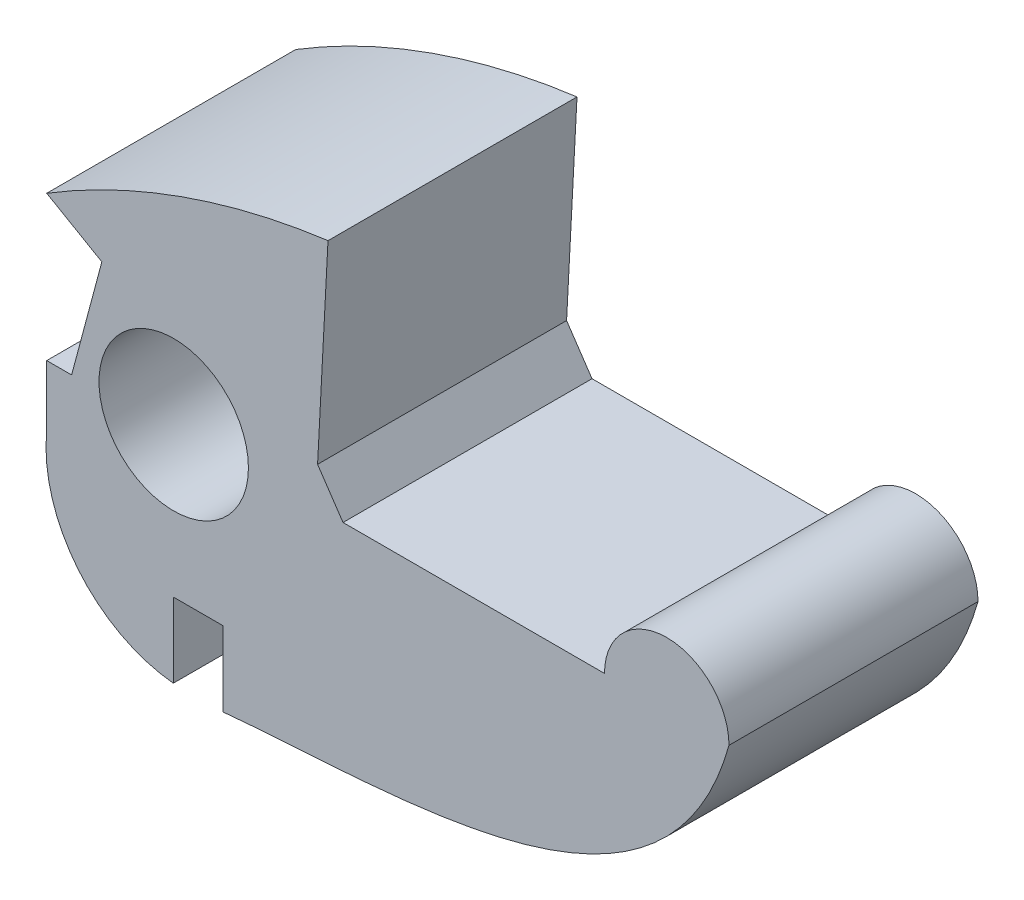
ISO-10303-21;
HEADER;
FILE_DESCRIPTION(('STEP AP214'),'2;1');
FILE_NAME('part.step','',(''),(''),'','','');
FILE_SCHEMA(('AUTOMOTIVE_DESIGN { 1 0 10303 214 1 1 1 1 }'));
ENDSEC;
DATA;
#1=APPLICATION_CONTEXT('core data for automotive mechanical design processes');
#2=APPLICATION_PROTOCOL_DEFINITION('international standard','automotive_design',2000,#1);
#3=PRODUCT_CONTEXT('',#1,'mechanical');
#4=PRODUCT('Part','Part','',(#3));
#5=PRODUCT_RELATED_PRODUCT_CATEGORY('part','',(#4));
#6=PRODUCT_DEFINITION_FORMATION('','',#4);
#7=PRODUCT_DEFINITION_CONTEXT('part definition',#1,'design');
#8=PRODUCT_DEFINITION('design','',#6,#7);
#9=PRODUCT_DEFINITION_SHAPE('','',#8);
#10=(LENGTH_UNIT() NAMED_UNIT(*) SI_UNIT(.MILLI.,.METRE.));
#11=(NAMED_UNIT(*) PLANE_ANGLE_UNIT() SI_UNIT($,.RADIAN.));
#12=(NAMED_UNIT(*) SI_UNIT($,.STERADIAN.) SOLID_ANGLE_UNIT());
#13=UNCERTAINTY_MEASURE_WITH_UNIT(LENGTH_MEASURE(1.E-05),#10,'distance_accuracy_value','');
#14=(GEOMETRIC_REPRESENTATION_CONTEXT(3) GLOBAL_UNCERTAINTY_ASSIGNED_CONTEXT((#13)) GLOBAL_UNIT_ASSIGNED_CONTEXT((#10,
#11,#12)) REPRESENTATION_CONTEXT('',''));
#15=CARTESIAN_POINT('',(0.,0.,0.));
#16=DIRECTION('',(0.,0.,1.));
#17=DIRECTION('',(1.,0.,0.));
#18=AXIS2_PLACEMENT_3D('',#15,#16,#17);
#19=CARTESIAN_POINT('',(15.5,0.,10.));
#20=CARTESIAN_POINT('',(12.9760479301771,-9.01098346788122,10.));
#21=CARTESIAN_POINT('',(2.1152250635475,-8.3312576021562,10.));
#22=CARTESIAN_POINT('',(-4.81703295022904,-9.,10.));
#23=B_SPLINE_CURVE_WITH_KNOTS('',3,(#19,#20,#21,#22),.UNSPECIFIED.,.F.,.F.,(4,4),(0.,1.),.UNSPECIFIED.);
#24=DIRECTION('',(0.,0.,-1.));
#25=VECTOR('',#24,1.);
#26=SURFACE_OF_LINEAR_EXTRUSION('',#23,#25);
#27=CARTESIAN_POINT('',(15.5,0.,0.));
#28=CARTESIAN_POINT('',(12.9760479301771,-9.01098346788122,0.));
#29=CARTESIAN_POINT('',(2.1152250635475,-8.3312576021562,0.));
#30=CARTESIAN_POINT('',(-4.81703295022904,-9.,0.));
#31=B_SPLINE_CURVE_WITH_KNOTS('',3,(#27,#28,#29,#30),.UNSPECIFIED.,.F.,.F.,(4,4),(0.,1.),.UNSPECIFIED.);
#32=CARTESIAN_POINT('',(15.5,0.,0.));
#33=VERTEX_POINT('',#32);
#34=CARTESIAN_POINT('',(-4.8170329502291,-9.,0.));
#35=VERTEX_POINT('',#34);
#36=EDGE_CURVE('E168',#33,#35,#31,.T.);
#37=ORIENTED_EDGE('',*,*,#36,.F.);
#38=DIRECTION('',(0.,0.,-1.));
#39=VECTOR('',#38,1.);
#40=CARTESIAN_POINT('',(15.5,0.,10.));
#41=LINE('',#40,#39);
#42=CARTESIAN_POINT('',(15.5,0.,10.));
#43=VERTEX_POINT('',#42);
#44=EDGE_CURVE('E11',#43,#33,#41,.T.);
#45=ORIENTED_EDGE('',*,*,#44,.F.);
#46=CARTESIAN_POINT('',(-4.8170329502291,-9.,10.));
#47=VERTEX_POINT('',#46);
#48=EDGE_CURVE('E208',#43,#47,#23,.T.);
#49=ORIENTED_EDGE('',*,*,#48,.T.);
#50=DIRECTION('',(0.,0.,-1.));
#51=VECTOR('',#50,1.);
#52=CARTESIAN_POINT('',(-4.8170329502291,-9.,10.));
#53=LINE('',#52,#51);
#54=EDGE_CURVE('E104',#47,#35,#53,.T.);
#55=ORIENTED_EDGE('',*,*,#54,.T.);
#56=EDGE_LOOP('',(#37,#45,#49,#55));
#57=FACE_BOUND('',#56,.T.);
#58=ADVANCED_FACE('F34',(#57),#26,.T.);
#59=CARTESIAN_POINT('',(13.,0.,10.));
#60=DIRECTION('',(0.,0.,-1.));
#61=DIRECTION('',(-1.,0.,0.));
#62=AXIS2_PLACEMENT_3D('',#59,#60,#61);
#63=CYLINDRICAL_SURFACE('',#62,2.5);
#64=CARTESIAN_POINT('',(13.,0.,0.));
#65=DIRECTION('',(0.,0.,1.));
#66=DIRECTION('',(1.,0.,0.));
#67=AXIS2_PLACEMENT_3D('',#64,#65,#66);
#68=CIRCLE('',#67,2.5);
#69=CARTESIAN_POINT('',(10.5,0.,0.));
#70=VERTEX_POINT('',#69);
#71=EDGE_CURVE('E173',#33,#70,#68,.T.);
#72=ORIENTED_EDGE('',*,*,#71,.T.);
#73=DIRECTION('',(0.,0.,-1.));
#74=VECTOR('',#73,1.);
#75=CARTESIAN_POINT('',(10.5,0.,10.));
#76=LINE('',#75,#74);
#77=CARTESIAN_POINT('',(10.5,0.,10.));
#78=VERTEX_POINT('',#77);
#79=EDGE_CURVE('E43',#78,#70,#76,.T.);
#80=ORIENTED_EDGE('',*,*,#79,.F.);
#81=CARTESIAN_POINT('',(13.,0.,10.));
#82=DIRECTION('',(0.,0.,1.));
#83=DIRECTION('',(1.,0.,0.));
#84=AXIS2_PLACEMENT_3D('',#81,#82,#83);
#85=CIRCLE('',#84,2.5);
#86=EDGE_CURVE('E253',#43,#78,#85,.T.);
#87=ORIENTED_EDGE('',*,*,#86,.F.);
#88=ORIENTED_EDGE('',*,*,#44,.T.);
#89=EDGE_LOOP('',(#72,#80,#87,#88));
#90=FACE_BOUND('',#89,.T.);
#91=ADVANCED_FACE('F240',(#90),#63,.T.);
#92=CARTESIAN_POINT('',(0.,0.,10.));
#93=DIRECTION('',(0.,1.,0.));
#94=DIRECTION('',(-1.,0.,0.));
#95=AXIS2_PLACEMENT_3D('',#92,#93,#94);
#96=PLANE('',#95);
#97=DIRECTION('',(1.,0.,0.));
#98=VECTOR('',#97,1.);
#99=CARTESIAN_POINT('',(0.,0.,0.));
#100=LINE('',#99,#98);
#101=CARTESIAN_POINT('',(0.,0.,0.));
#102=VERTEX_POINT('',#101);
#103=EDGE_CURVE('E179',#102,#70,#100,.T.);
#104=ORIENTED_EDGE('',*,*,#103,.F.);
#105=DIRECTION('',(0.,0.,-1.));
#106=VECTOR('',#105,1.);
#107=CARTESIAN_POINT('',(0.,0.,10.));
#108=LINE('',#107,#106);
#109=CARTESIAN_POINT('',(0.,0.,10.));
#110=VERTEX_POINT('',#109);
#111=EDGE_CURVE('E230',#110,#102,#108,.T.);
#112=ORIENTED_EDGE('',*,*,#111,.F.);
#113=DIRECTION('',(1.,0.,0.));
#114=VECTOR('',#113,1.);
#115=CARTESIAN_POINT('',(0.,0.,10.));
#116=LINE('',#115,#114);
#117=EDGE_CURVE('E237',#110,#78,#116,.T.);
#118=ORIENTED_EDGE('',*,*,#117,.T.);
#119=ORIENTED_EDGE('',*,*,#79,.T.);
#120=EDGE_LOOP('',(#104,#112,#118,#119));
#121=FACE_BOUND('',#120,.T.);
#122=ADVANCED_FACE('F235',(#121),#96,.T.);
#123=CARTESIAN_POINT('',(0.,0.,10.));
#124=DIRECTION('',(0.82823232516065,0.560384881629567,0.));
#125=DIRECTION('',(-0.560384881629567,0.82823232516065,0.));
#126=AXIS2_PLACEMENT_3D('',#123,#124,#125);
#127=PLANE('',#126);
#128=DIRECTION('',(0.560384881629567,-0.82823232516065,0.));
#129=VECTOR('',#128,1.);
#130=CARTESIAN_POINT('',(0.,0.,0.));
#131=LINE('',#130,#129);
#132=CARTESIAN_POINT('',(-1.02232332735238,1.5109637219634,0.));
#133=VERTEX_POINT('',#132);
#134=EDGE_CURVE('E182',#133,#102,#131,.T.);
#135=ORIENTED_EDGE('',*,*,#134,.F.);
#136=DIRECTION('',(0.,0.,-1.));
#137=VECTOR('',#136,1.);
#138=CARTESIAN_POINT('',(-1.02232332735238,1.5109637219634,10.));
#139=LINE('',#138,#137);
#140=CARTESIAN_POINT('',(-1.02232332735238,1.5109637219634,10.));
#141=VERTEX_POINT('',#140);
#142=EDGE_CURVE('E228',#141,#133,#139,.T.);
#143=ORIENTED_EDGE('',*,*,#142,.F.);
#144=DIRECTION('',(0.560384881629567,-0.82823232516065,0.));
#145=VECTOR('',#144,1.);
#146=CARTESIAN_POINT('',(0.,0.,10.));
#147=LINE('',#146,#145);
#148=EDGE_CURVE('E250',#141,#110,#147,.T.);
#149=ORIENTED_EDGE('',*,*,#148,.T.);
#150=ORIENTED_EDGE('',*,*,#111,.T.);
#151=EDGE_LOOP('',(#135,#143,#149,#150));
#152=FACE_BOUND('',#151,.T.);
#153=ADVANCED_FACE('F247',(#152),#127,.T.);
#154=CARTESIAN_POINT('',(-1.09849248823003,0.0575695518672342,10.));
#155=DIRECTION('',(0.998629534754574,-0.0523359562429402,0.));
#156=DIRECTION('',(0.0523359562429402,0.998629534754574,0.));
#157=AXIS2_PLACEMENT_3D('',#154,#155,#156);
#158=PLANE('',#157);
#159=DIRECTION('',(-0.0523359562429402,-0.998629534754574,0.));
#160=VECTOR('',#159,1.);
#161=CARTESIAN_POINT('',(-1.09849248823003,0.0575695518672342,0.));
#162=LINE('',#161,#160);
#163=CARTESIAN_POINT('',(-0.603635677408855,9.49999999999999,0.));
#164=VERTEX_POINT('',#163);
#165=EDGE_CURVE('E185',#164,#133,#162,.T.);
#166=ORIENTED_EDGE('',*,*,#165,.F.);
#167=DIRECTION('',(0.,0.,-1.));
#168=VECTOR('',#167,1.);
#169=CARTESIAN_POINT('',(-0.603635677408855,9.49999999999999,10.));
#170=LINE('',#169,#168);
#171=CARTESIAN_POINT('',(-0.603635677408855,9.49999999999999,10.));
#172=VERTEX_POINT('',#171);
#173=EDGE_CURVE('E226',#172,#164,#170,.T.);
#174=ORIENTED_EDGE('',*,*,#173,.F.);
#175=DIRECTION('',(-0.0523359562429402,-0.998629534754574,0.));
#176=VECTOR('',#175,1.);
#177=CARTESIAN_POINT('',(-1.09849248823003,0.0575695518672342,10.));
#178=LINE('',#177,#176);
#179=EDGE_CURVE('E255',#172,#141,#178,.T.);
#180=ORIENTED_EDGE('',*,*,#179,.T.);
#181=ORIENTED_EDGE('',*,*,#142,.T.);
#182=EDGE_LOOP('',(#166,#174,#180,#181));
#183=FACE_BOUND('',#182,.T.);
#184=ADVANCED_FACE('F300',(#183),#158,.T.);
#185=CARTESIAN_POINT('',(3.11971648686195,-18.9660665008166,10.));
#186=DIRECTION('',(0.,0.,-1.));
#187=DIRECTION('',(-1.,0.,0.));
#188=AXIS2_PLACEMENT_3D('',#185,#186,#187);
#189=CYLINDRICAL_SURFACE('',#188,28.7085404255962);
#190=CARTESIAN_POINT('',(3.11971648686195,-18.9660665008166,0.));
#191=DIRECTION('',(0.,0.,1.));
#192=DIRECTION('',(1.,0.,0.));
#193=AXIS2_PLACEMENT_3D('',#190,#191,#192);
#194=CIRCLE('',#193,28.7085404255962);
#195=CARTESIAN_POINT('',(-11.9,5.49999999999999,0.));
#196=VERTEX_POINT('',#195);
#197=EDGE_CURVE('E188',#196,#164,#194,.F.);
#198=ORIENTED_EDGE('',*,*,#197,.F.);
#199=DIRECTION('',(0.,0.,-1.));
#200=VECTOR('',#199,1.);
#201=CARTESIAN_POINT('',(-11.9,5.49999999999999,10.));
#202=LINE('',#201,#200);
#203=CARTESIAN_POINT('',(-11.9,5.49999999999999,10.));
#204=VERTEX_POINT('',#203);
#205=EDGE_CURVE('E224',#204,#196,#202,.T.);
#206=ORIENTED_EDGE('',*,*,#205,.F.);
#207=CARTESIAN_POINT('',(3.11971648686195,-18.9660665008166,10.));
#208=DIRECTION('',(0.,0.,1.));
#209=DIRECTION('',(1.,0.,0.));
#210=AXIS2_PLACEMENT_3D('',#207,#208,#209);
#211=CIRCLE('',#210,28.7085404255962);
#212=EDGE_CURVE('E260',#204,#172,#211,.F.);
#213=ORIENTED_EDGE('',*,*,#212,.T.);
#214=ORIENTED_EDGE('',*,*,#173,.T.);
#215=EDGE_LOOP('',(#198,#206,#213,#214));
#216=FACE_BOUND('',#215,.T.);
#217=ADVANCED_FACE('F303',(#216),#189,.T.);
#218=CARTESIAN_POINT('',(-0.593430139592831,-1.02785115251746,10.));
#219=DIRECTION('',(0.500000000000004,0.866025403784436,0.));
#220=DIRECTION('',(-0.866025403784436,0.500000000000004,0.));
#221=AXIS2_PLACEMENT_3D('',#218,#219,#220);
#222=PLANE('',#221);
#223=DIRECTION('',(0.866025403784436,-0.500000000000004,0.));
#224=VECTOR('',#223,1.);
#225=CARTESIAN_POINT('',(-0.593430139592831,-1.02785115251746,0.));
#226=LINE('',#225,#224);
#227=CARTESIAN_POINT('',(-9.68601796190731,4.22175687432617,0.));
#228=VERTEX_POINT('',#227);
#229=EDGE_CURVE('E191',#196,#228,#226,.T.);
#230=ORIENTED_EDGE('',*,*,#229,.T.);
#231=DIRECTION('',(0.,0.,-1.));
#232=VECTOR('',#231,1.);
#233=CARTESIAN_POINT('',(-9.68601796190731,4.22175687432617,10.));
#234=LINE('',#233,#232);
#235=CARTESIAN_POINT('',(-9.68601796190731,4.22175687432617,10.));
#236=VERTEX_POINT('',#235);
#237=EDGE_CURVE('E221',#236,#228,#234,.T.);
#238=ORIENTED_EDGE('',*,*,#237,.F.);
#239=DIRECTION('',(0.866025403784436,-0.500000000000004,0.));
#240=VECTOR('',#239,1.);
#241=CARTESIAN_POINT('',(-0.593430139592831,-1.02785115251746,10.));
#242=LINE('',#241,#240);
#243=EDGE_CURVE('E263',#204,#236,#242,.T.);
#244=ORIENTED_EDGE('',*,*,#243,.F.);
#245=ORIENTED_EDGE('',*,*,#205,.T.);
#246=EDGE_LOOP('',(#230,#238,#244,#245));
#247=FACE_BOUND('',#246,.T.);
#248=ADVANCED_FACE('F307',(#247),#222,.F.);
#249=CARTESIAN_POINT('',(-10.0932589351048,2.69860216904226,10.));
#250=DIRECTION('',(0.966066345234463,-0.258294050658018,0.));
#251=DIRECTION('',(0.258294050658018,0.966066345234463,0.));
#252=AXIS2_PLACEMENT_3D('',#249,#250,#251);
#253=PLANE('',#252);
#254=DIRECTION('',(-0.258294050658018,-0.966066345234463,0.));
#255=VECTOR('',#254,1.);
#256=CARTESIAN_POINT('',(-10.0932589351048,2.69860216904226,0.));
#257=LINE('',#256,#255);
#258=CARTESIAN_POINT('',(-10.9,-0.318754948275805,0.));
#259=VERTEX_POINT('',#258);
#260=EDGE_CURVE('E193',#228,#259,#257,.T.);
#261=ORIENTED_EDGE('',*,*,#260,.T.);
#262=DIRECTION('',(0.,0.,-1.));
#263=VECTOR('',#262,1.);
#264=CARTESIAN_POINT('',(-10.9,-0.318754948275805,10.));
#265=LINE('',#264,#263);
#266=CARTESIAN_POINT('',(-10.9,-0.318754948275805,10.));
#267=VERTEX_POINT('',#266);
#268=EDGE_CURVE('E218',#267,#259,#265,.T.);
#269=ORIENTED_EDGE('',*,*,#268,.F.);
#270=DIRECTION('',(-0.258294050658018,-0.966066345234463,0.));
#271=VECTOR('',#270,1.);
#272=CARTESIAN_POINT('',(-10.0932589351048,2.69860216904226,10.));
#273=LINE('',#272,#271);
#274=EDGE_CURVE('E265',#236,#267,#273,.T.);
#275=ORIENTED_EDGE('',*,*,#274,.F.);
#276=ORIENTED_EDGE('',*,*,#237,.T.);
#277=EDGE_LOOP('',(#261,#269,#275,#276));
#278=FACE_BOUND('',#277,.T.);
#279=ADVANCED_FACE('F311',(#278),#253,.F.);
#280=CARTESIAN_POINT('',(0.,-0.318754948275803,10.));
#281=DIRECTION('',(0.,-1.,0.));
#282=DIRECTION('',(1.,0.,0.));
#283=AXIS2_PLACEMENT_3D('',#280,#281,#282);
#284=PLANE('',#283);
#285=DIRECTION('',(-1.,0.,0.));
#286=VECTOR('',#285,1.);
#287=CARTESIAN_POINT('',(0.,-0.318754948275803,0.));
#288=LINE('',#287,#286);
#289=CARTESIAN_POINT('',(-11.9,-0.318754948275805,0.));
#290=VERTEX_POINT('',#289);
#291=EDGE_CURVE('E195',#259,#290,#288,.T.);
#292=ORIENTED_EDGE('',*,*,#291,.T.);
#293=DIRECTION('',(0.,0.,-1.));
#294=VECTOR('',#293,1.);
#295=CARTESIAN_POINT('',(-11.9,-0.318754948275805,10.));
#296=LINE('',#295,#294);
#297=CARTESIAN_POINT('',(-11.9,-0.318754948275805,10.));
#298=VERTEX_POINT('',#297);
#299=EDGE_CURVE('E215',#298,#290,#296,.T.);
#300=ORIENTED_EDGE('',*,*,#299,.F.);
#301=DIRECTION('',(-1.,0.,0.));
#302=VECTOR('',#301,1.);
#303=CARTESIAN_POINT('',(0.,-0.318754948275803,10.));
#304=LINE('',#303,#302);
#305=EDGE_CURVE('E267',#267,#298,#304,.T.);
#306=ORIENTED_EDGE('',*,*,#305,.F.);
#307=ORIENTED_EDGE('',*,*,#268,.T.);
#308=EDGE_LOOP('',(#292,#300,#306,#307));
#309=FACE_BOUND('',#308,.T.);
#310=ADVANCED_FACE('F315',(#309),#284,.F.);
#311=CARTESIAN_POINT('',(-11.9,0.,10.));
#312=DIRECTION('',(1.,0.,0.));
#313=DIRECTION('',(0.,0.,-1.));
#314=AXIS2_PLACEMENT_3D('',#311,#312,#313);
#315=PLANE('',#314);
#316=DIRECTION('',(0.,-1.,0.));
#317=VECTOR('',#316,1.);
#318=CARTESIAN_POINT('',(-11.9,0.,0.));
#319=LINE('',#318,#317);
#320=CARTESIAN_POINT('',(-11.9,-2.76925855078619,0.));
#321=VERTEX_POINT('',#320);
#322=EDGE_CURVE('E197',#290,#321,#319,.T.);
#323=ORIENTED_EDGE('',*,*,#322,.T.);
#324=DIRECTION('',(0.,0.,-1.));
#325=VECTOR('',#324,1.);
#326=CARTESIAN_POINT('',(-11.9,-2.76925855078619,10.));
#327=LINE('',#326,#325);
#328=CARTESIAN_POINT('',(-11.9,-2.76925855078619,10.));
#329=VERTEX_POINT('',#328);
#330=EDGE_CURVE('E212',#329,#321,#327,.T.);
#331=ORIENTED_EDGE('',*,*,#330,.F.);
#332=DIRECTION('',(0.,-1.,0.));
#333=VECTOR('',#332,1.);
#334=CARTESIAN_POINT('',(-11.9,0.,10.));
#335=LINE('',#334,#333);
#336=EDGE_CURVE('E269',#298,#329,#335,.T.);
#337=ORIENTED_EDGE('',*,*,#336,.F.);
#338=ORIENTED_EDGE('',*,*,#299,.T.);
#339=EDGE_LOOP('',(#323,#331,#337,#338));
#340=FACE_BOUND('',#339,.T.);
#341=ADVANCED_FACE('F275',(#340),#315,.F.);
#342=CARTESIAN_POINT('',(-6.24314575050761,-3.34314575050762,10.));
#343=DIRECTION('',(0.,0.,-1.));
#344=DIRECTION('',(-1.,0.,0.));
#345=AXIS2_PLACEMENT_3D('',#342,#343,#344);
#346=CYLINDRICAL_SURFACE('',#345,5.6858901253897);
#347=CARTESIAN_POINT('',(-6.24314575050761,-3.34314575050762,0.));
#348=DIRECTION('',(0.,0.,1.));
#349=DIRECTION('',(1.,0.,0.));
#350=AXIS2_PLACEMENT_3D('',#347,#348,#349);
#351=CIRCLE('',#350,5.6858901253897);
#352=CARTESIAN_POINT('',(-6.8170329502291,-9.,0.));
#353=VERTEX_POINT('',#352);
#354=EDGE_CURVE('E199',#321,#353,#351,.T.);
#355=ORIENTED_EDGE('',*,*,#354,.T.);
#356=DIRECTION('',(0.,0.,-1.));
#357=VECTOR('',#356,1.);
#358=CARTESIAN_POINT('',(-6.8170329502291,-9.,10.));
#359=LINE('',#358,#357);
#360=CARTESIAN_POINT('',(-6.8170329502291,-9.,10.));
#361=VERTEX_POINT('',#360);
#362=EDGE_CURVE('E157',#361,#353,#359,.T.);
#363=ORIENTED_EDGE('',*,*,#362,.F.);
#364=CARTESIAN_POINT('',(-6.24314575050761,-3.34314575050762,10.));
#365=DIRECTION('',(0.,0.,1.));
#366=DIRECTION('',(1.,0.,0.));
#367=AXIS2_PLACEMENT_3D('',#364,#365,#366);
#368=CIRCLE('',#367,5.6858901253897);
#369=EDGE_CURVE('E148',#329,#361,#368,.T.);
#370=ORIENTED_EDGE('',*,*,#369,.F.);
#371=ORIENTED_EDGE('',*,*,#330,.T.);
#372=EDGE_LOOP('',(#355,#363,#370,#371));
#373=FACE_BOUND('',#372,.T.);
#374=ADVANCED_FACE('F279',(#373),#346,.T.);
#375=CARTESIAN_POINT('',(-6.8170329502291,0.,10.));
#376=DIRECTION('',(-1.,0.,0.));
#377=DIRECTION('',(0.,-1.,0.));
#378=AXIS2_PLACEMENT_3D('',#375,#376,#377);
#379=PLANE('',#378);
#380=DIRECTION('',(0.,1.,0.));
#381=VECTOR('',#380,1.);
#382=CARTESIAN_POINT('',(-6.8170329502291,0.,0.));
#383=LINE('',#382,#381);
#384=CARTESIAN_POINT('',(-6.8170329502291,-5.99999999999979,0.));
#385=VERTEX_POINT('',#384);
#386=EDGE_CURVE('E156',#353,#385,#383,.T.);
#387=ORIENTED_EDGE('',*,*,#386,.T.);
#388=DIRECTION('',(0.,0.,-1.));
#389=VECTOR('',#388,1.);
#390=CARTESIAN_POINT('',(-6.8170329502291,-5.99999999999979,10.));
#391=LINE('',#390,#389);
#392=CARTESIAN_POINT('',(-6.8170329502291,-5.99999999999979,10.));
#393=VERTEX_POINT('',#392);
#394=EDGE_CURVE('E153',#393,#385,#391,.T.);
#395=ORIENTED_EDGE('',*,*,#394,.F.);
#396=DIRECTION('',(0.,1.,0.));
#397=VECTOR('',#396,1.);
#398=CARTESIAN_POINT('',(-6.8170329502291,0.,10.));
#399=LINE('',#398,#397);
#400=EDGE_CURVE('E141',#361,#393,#399,.T.);
#401=ORIENTED_EDGE('',*,*,#400,.F.);
#402=ORIENTED_EDGE('',*,*,#362,.T.);
#403=EDGE_LOOP('',(#387,#395,#401,#402));
#404=FACE_BOUND('',#403,.T.);
#405=ADVANCED_FACE('F154',(#404),#379,.F.);
#406=CARTESIAN_POINT('',(0.,-5.99999999999976,10.));
#407=DIRECTION('',(0.,1.,0.));
#408=DIRECTION('',(-1.,0.,0.));
#409=AXIS2_PLACEMENT_3D('',#406,#407,#408);
#410=PLANE('',#409);
#411=DIRECTION('',(1.,0.,0.));
#412=VECTOR('',#411,1.);
#413=CARTESIAN_POINT('',(0.,-5.99999999999976,0.));
#414=LINE('',#413,#412);
#415=CARTESIAN_POINT('',(-4.8170329502291,-5.99999999999978,0.));
#416=VERTEX_POINT('',#415);
#417=EDGE_CURVE('E97',#385,#416,#414,.T.);
#418=ORIENTED_EDGE('',*,*,#417,.T.);
#419=DIRECTION('',(0.,0.,-1.));
#420=VECTOR('',#419,1.);
#421=CARTESIAN_POINT('',(-4.8170329502291,-5.99999999999978,10.));
#422=LINE('',#421,#420);
#423=CARTESIAN_POINT('',(-4.8170329502291,-5.99999999999978,10.));
#424=VERTEX_POINT('',#423);
#425=EDGE_CURVE('E158',#424,#416,#422,.T.);
#426=ORIENTED_EDGE('',*,*,#425,.F.);
#427=DIRECTION('',(1.,0.,0.));
#428=VECTOR('',#427,1.);
#429=CARTESIAN_POINT('',(0.,-5.99999999999976,10.));
#430=LINE('',#429,#428);
#431=EDGE_CURVE('E146',#393,#424,#430,.T.);
#432=ORIENTED_EDGE('',*,*,#431,.F.);
#433=ORIENTED_EDGE('',*,*,#394,.T.);
#434=EDGE_LOOP('',(#418,#426,#432,#433));
#435=FACE_BOUND('',#434,.T.);
#436=ADVANCED_FACE('F160',(#435),#410,.F.);
#437=CARTESIAN_POINT('',(-4.8170329502291,0.,10.));
#438=DIRECTION('',(1.,0.,0.));
#439=DIRECTION('',(0.,0.,-1.));
#440=AXIS2_PLACEMENT_3D('',#437,#438,#439);
#441=PLANE('',#440);
#442=DIRECTION('',(0.,-1.,0.));
#443=VECTOR('',#442,1.);
#444=CARTESIAN_POINT('',(-4.8170329502291,0.,0.));
#445=LINE('',#444,#443);
#446=EDGE_CURVE('E203',#416,#35,#445,.T.);
#447=ORIENTED_EDGE('',*,*,#446,.T.);
#448=ORIENTED_EDGE('',*,*,#54,.F.);
#449=DIRECTION('',(0.,-1.,0.));
#450=VECTOR('',#449,1.);
#451=CARTESIAN_POINT('',(-4.8170329502291,0.,10.));
#452=LINE('',#451,#450);
#453=EDGE_CURVE('E51',#424,#47,#452,.T.);
#454=ORIENTED_EDGE('',*,*,#453,.F.);
#455=ORIENTED_EDGE('',*,*,#425,.T.);
#456=EDGE_LOOP('',(#447,#448,#454,#455));
#457=FACE_BOUND('',#456,.T.);
#458=ADVANCED_FACE('F282',(#457),#441,.F.);
#459=CARTESIAN_POINT('',(-6.8,0.,10.));
#460=DIRECTION('',(0.,0.,-1.));
#461=DIRECTION('',(-1.,0.,0.));
#462=AXIS2_PLACEMENT_3D('',#459,#460,#461);
#463=CYLINDRICAL_SURFACE('',#462,3.);
#464=CARTESIAN_POINT('',(-6.8,0.,10.));
#465=DIRECTION('',(0.,0.,1.));
#466=DIRECTION('',(1.,0.,0.));
#467=AXIS2_PLACEMENT_3D('',#464,#465,#466);
#468=CIRCLE('',#467,3.);
#469=CARTESIAN_POINT('',(-3.8,0.,10.));
#470=VERTEX_POINT('',#469);
#471=EDGE_CURVE('E162',#470,#470,#468,.T.);
#472=ORIENTED_EDGE('',*,*,#471,.T.);
#473=EDGE_LOOP('',(#472));
#474=FACE_BOUND('',#473,.T.);
#475=CARTESIAN_POINT('',(-6.8,0.,0.));
#476=DIRECTION('',(0.,0.,1.));
#477=DIRECTION('',(1.,0.,0.));
#478=AXIS2_PLACEMENT_3D('',#475,#476,#477);
#479=CIRCLE('',#478,3.);
#480=CARTESIAN_POINT('',(-3.8,0.,0.));
#481=VERTEX_POINT('',#480);
#482=EDGE_CURVE('E205',#481,#481,#479,.T.);
#483=ORIENTED_EDGE('',*,*,#482,.F.);
#484=EDGE_LOOP('',(#483));
#485=FACE_BOUND('',#484,.T.);
#486=ADVANCED_FACE('F330',(#474,#485),#463,.F.);
#487=CARTESIAN_POINT('',(0.,0.,10.));
#488=DIRECTION('',(0.,0.,1.));
#489=DIRECTION('',(1.,0.,0.));
#490=AXIS2_PLACEMENT_3D('',#487,#488,#489);
#491=PLANE('',#490);
#492=ORIENTED_EDGE('',*,*,#48,.F.);
#493=ORIENTED_EDGE('',*,*,#86,.T.);
#494=ORIENTED_EDGE('',*,*,#117,.F.);
#495=ORIENTED_EDGE('',*,*,#148,.F.);
#496=ORIENTED_EDGE('',*,*,#179,.F.);
#497=ORIENTED_EDGE('',*,*,#212,.F.);
#498=ORIENTED_EDGE('',*,*,#243,.T.);
#499=ORIENTED_EDGE('',*,*,#274,.T.);
#500=ORIENTED_EDGE('',*,*,#305,.T.);
#501=ORIENTED_EDGE('',*,*,#336,.T.);
#502=ORIENTED_EDGE('',*,*,#369,.T.);
#503=ORIENTED_EDGE('',*,*,#400,.T.);
#504=ORIENTED_EDGE('',*,*,#431,.T.);
#505=ORIENTED_EDGE('',*,*,#453,.T.);
#506=EDGE_LOOP('',(#492,#493,#494,#495,#496,#497,#498,#499,#500,#501,#502,#503,#504,#505));
#507=FACE_BOUND('',#506,.T.);
#508=ORIENTED_EDGE('',*,*,#471,.F.);
#509=EDGE_LOOP('',(#508));
#510=FACE_BOUND('',#509,.T.);
#511=ADVANCED_FACE('F143',(#507,#510),#491,.T.);
#512=CARTESIAN_POINT('',(0.,0.,0.));
#513=DIRECTION('',(0.,0.,1.));
#514=DIRECTION('',(1.,0.,0.));
#515=AXIS2_PLACEMENT_3D('',#512,#513,#514);
#516=PLANE('',#515);
#517=ORIENTED_EDGE('',*,*,#36,.T.);
#518=ORIENTED_EDGE('',*,*,#446,.F.);
#519=ORIENTED_EDGE('',*,*,#417,.F.);
#520=ORIENTED_EDGE('',*,*,#386,.F.);
#521=ORIENTED_EDGE('',*,*,#354,.F.);
#522=ORIENTED_EDGE('',*,*,#322,.F.);
#523=ORIENTED_EDGE('',*,*,#291,.F.);
#524=ORIENTED_EDGE('',*,*,#260,.F.);
#525=ORIENTED_EDGE('',*,*,#229,.F.);
#526=ORIENTED_EDGE('',*,*,#197,.T.);
#527=ORIENTED_EDGE('',*,*,#165,.T.);
#528=ORIENTED_EDGE('',*,*,#134,.T.);
#529=ORIENTED_EDGE('',*,*,#103,.T.);
#530=ORIENTED_EDGE('',*,*,#71,.F.);
#531=EDGE_LOOP('',(#517,#518,#519,#520,#521,#522,#523,#524,#525,#526,#527,#528,#529,#530));
#532=FACE_BOUND('',#531,.T.);
#533=ORIENTED_EDGE('',*,*,#482,.T.);
#534=EDGE_LOOP('',(#533));
#535=FACE_BOUND('',#534,.T.);
#536=ADVANCED_FACE('F242',(#532,#535),#516,.F.);
#537=CLOSED_SHELL('',(#58,#91,#122,#153,#184,#217,#248,#279,#310,#341,#374,#405,#436,#458,#486,
#511,#536));
#538=MANIFOLD_SOLID_BREP('B2',#537);
#539=ADVANCED_BREP_SHAPE_REPRESENTATION('',(#18,#538),#14);
#540=SHAPE_DEFINITION_REPRESENTATION(#9,#539);
ENDSEC;
END-ISO-10303-21;
